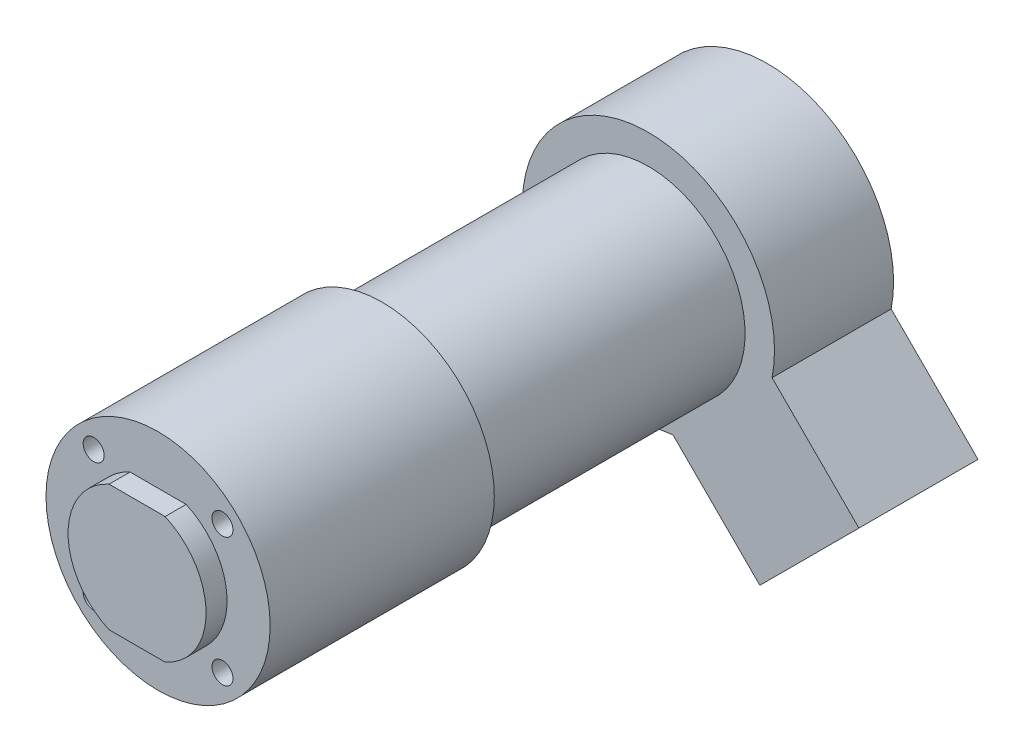
ISO-10303-21;
HEADER;
FILE_DESCRIPTION(('STEP AP214'),'2;1');
FILE_NAME('part.step','',(''),(''),'','','');
FILE_SCHEMA(('AUTOMOTIVE_DESIGN { 1 0 10303 214 1 1 1 1 }'));
ENDSEC;
DATA;
#1=APPLICATION_CONTEXT('core data for automotive mechanical design processes');
#2=APPLICATION_PROTOCOL_DEFINITION('international standard','automotive_design',2000,#1);
#3=PRODUCT_CONTEXT('',#1,'mechanical');
#4=PRODUCT('Part','Part','',(#3));
#5=PRODUCT_RELATED_PRODUCT_CATEGORY('part','',(#4));
#6=PRODUCT_DEFINITION_FORMATION('','',#4);
#7=PRODUCT_DEFINITION_CONTEXT('part definition',#1,'design');
#8=PRODUCT_DEFINITION('design','',#6,#7);
#9=PRODUCT_DEFINITION_SHAPE('','',#8);
#10=(LENGTH_UNIT() NAMED_UNIT(*) SI_UNIT(.MILLI.,.METRE.));
#11=(NAMED_UNIT(*) PLANE_ANGLE_UNIT() SI_UNIT($,.RADIAN.));
#12=(NAMED_UNIT(*) SI_UNIT($,.STERADIAN.) SOLID_ANGLE_UNIT());
#13=UNCERTAINTY_MEASURE_WITH_UNIT(LENGTH_MEASURE(1.E-05),#10,'distance_accuracy_value','');
#14=(GEOMETRIC_REPRESENTATION_CONTEXT(3) GLOBAL_UNCERTAINTY_ASSIGNED_CONTEXT((#13)) GLOBAL_UNIT_ASSIGNED_CONTEXT((#10,
#11,#12)) REPRESENTATION_CONTEXT('',''));
#15=CARTESIAN_POINT('',(0.,0.,0.));
#16=DIRECTION('',(0.,0.,1.));
#17=DIRECTION('',(1.,0.,0.));
#18=AXIS2_PLACEMENT_3D('',#15,#16,#17);
#19=CARTESIAN_POINT('',(0.,0.,3.));
#20=DIRECTION('',(0.,0.,-1.));
#21=DIRECTION('',(-1.,0.,0.));
#22=AXIS2_PLACEMENT_3D('',#19,#20,#21);
#23=CYLINDRICAL_SURFACE('',#22,9.85);
#24=CARTESIAN_POINT('',(0.,0.,0.));
#25=DIRECTION('',(0.,0.,1.));
#26=DIRECTION('',(1.,0.,0.));
#27=AXIS2_PLACEMENT_3D('',#24,#25,#26);
#28=CIRCLE('',#27,9.85);
#29=CARTESIAN_POINT('',(-4.00281151192509,9.,0.));
#30=VERTEX_POINT('',#29);
#31=CARTESIAN_POINT('',(-4.00281151192509,-9.,0.));
#32=VERTEX_POINT('',#31);
#33=EDGE_CURVE('E149',#30,#32,#28,.T.);
#34=ORIENTED_EDGE('',*,*,#33,.T.);
#35=DIRECTION('',(0.,0.,-1.));
#36=VECTOR('',#35,1.);
#37=CARTESIAN_POINT('',(-4.00281151192509,-9.,3.));
#38=LINE('',#37,#36);
#39=CARTESIAN_POINT('',(-4.00281151192509,-9.,3.));
#40=VERTEX_POINT('',#39);
#41=EDGE_CURVE('E41',#40,#32,#38,.T.);
#42=ORIENTED_EDGE('',*,*,#41,.F.);
#43=CARTESIAN_POINT('',(0.,0.,3.));
#44=DIRECTION('',(0.,0.,1.));
#45=DIRECTION('',(1.,0.,0.));
#46=AXIS2_PLACEMENT_3D('',#43,#44,#45);
#47=CIRCLE('',#46,9.85);
#48=CARTESIAN_POINT('',(-4.00281151192509,9.,3.));
#49=VERTEX_POINT('',#48);
#50=EDGE_CURVE('E152',#49,#40,#47,.T.);
#51=ORIENTED_EDGE('',*,*,#50,.F.);
#52=DIRECTION('',(0.,0.,-1.));
#53=VECTOR('',#52,1.);
#54=CARTESIAN_POINT('',(-4.00281151192509,9.,3.));
#55=LINE('',#54,#53);
#56=EDGE_CURVE('E160',#49,#30,#55,.T.);
#57=ORIENTED_EDGE('',*,*,#56,.T.);
#58=EDGE_LOOP('',(#34,#42,#51,#57));
#59=FACE_BOUND('',#58,.T.);
#60=ADVANCED_FACE('F38',(#59),#23,.T.);
#61=CARTESIAN_POINT('',(-4.00281151192509,-9.,3.));
#62=DIRECTION('',(0.,1.,0.));
#63=DIRECTION('',(-1.,0.,0.));
#64=AXIS2_PLACEMENT_3D('',#61,#62,#63);
#65=PLANE('',#64);
#66=DIRECTION('',(1.,0.,0.));
#67=VECTOR('',#66,1.);
#68=CARTESIAN_POINT('',(-4.00281151192509,-9.,0.));
#69=LINE('',#68,#67);
#70=CARTESIAN_POINT('',(4.00281151192509,-9.,0.));
#71=VERTEX_POINT('',#70);
#72=EDGE_CURVE('E163',#32,#71,#69,.T.);
#73=ORIENTED_EDGE('',*,*,#72,.T.);
#74=DIRECTION('',(0.,0.,-1.));
#75=VECTOR('',#74,1.);
#76=CARTESIAN_POINT('',(4.00281151192509,-9.,3.));
#77=LINE('',#76,#75);
#78=CARTESIAN_POINT('',(4.00281151192509,-9.,3.));
#79=VERTEX_POINT('',#78);
#80=EDGE_CURVE('E175',#79,#71,#77,.T.);
#81=ORIENTED_EDGE('',*,*,#80,.F.);
#82=DIRECTION('',(1.,0.,0.));
#83=VECTOR('',#82,1.);
#84=CARTESIAN_POINT('',(-4.00281151192509,-9.,3.));
#85=LINE('',#84,#83);
#86=EDGE_CURVE('E154',#40,#79,#85,.T.);
#87=ORIENTED_EDGE('',*,*,#86,.F.);
#88=ORIENTED_EDGE('',*,*,#41,.T.);
#89=EDGE_LOOP('',(#73,#81,#87,#88));
#90=FACE_BOUND('',#89,.T.);
#91=ADVANCED_FACE('F183',(#90),#65,.F.);
#92=CARTESIAN_POINT('',(0.,0.,3.));
#93=DIRECTION('',(0.,0.,-1.));
#94=DIRECTION('',(-1.,0.,0.));
#95=AXIS2_PLACEMENT_3D('',#92,#93,#94);
#96=CYLINDRICAL_SURFACE('',#95,9.85);
#97=CARTESIAN_POINT('',(0.,0.,0.));
#98=DIRECTION('',(0.,0.,1.));
#99=DIRECTION('',(1.,0.,0.));
#100=AXIS2_PLACEMENT_3D('',#97,#98,#99);
#101=CIRCLE('',#100,9.85);
#102=CARTESIAN_POINT('',(4.00281151192509,9.,0.));
#103=VERTEX_POINT('',#102);
#104=EDGE_CURVE('E166',#71,#103,#101,.T.);
#105=ORIENTED_EDGE('',*,*,#104,.T.);
#106=DIRECTION('',(0.,0.,-1.));
#107=VECTOR('',#106,1.);
#108=CARTESIAN_POINT('',(4.00281151192509,9.,3.));
#109=LINE('',#108,#107);
#110=CARTESIAN_POINT('',(4.00281151192509,9.,3.));
#111=VERTEX_POINT('',#110);
#112=EDGE_CURVE('E173',#111,#103,#109,.T.);
#113=ORIENTED_EDGE('',*,*,#112,.F.);
#114=CARTESIAN_POINT('',(0.,0.,3.));
#115=DIRECTION('',(0.,0.,1.));
#116=DIRECTION('',(1.,0.,0.));
#117=AXIS2_PLACEMENT_3D('',#114,#115,#116);
#118=CIRCLE('',#117,9.85);
#119=EDGE_CURVE('E157',#79,#111,#118,.T.);
#120=ORIENTED_EDGE('',*,*,#119,.F.);
#121=ORIENTED_EDGE('',*,*,#80,.T.);
#122=EDGE_LOOP('',(#105,#113,#120,#121));
#123=FACE_BOUND('',#122,.T.);
#124=ADVANCED_FACE('F193',(#123),#96,.T.);
#125=CARTESIAN_POINT('',(-4.00281151192509,9.,3.));
#126=DIRECTION('',(0.,-1.,0.));
#127=DIRECTION('',(1.,0.,0.));
#128=AXIS2_PLACEMENT_3D('',#125,#126,#127);
#129=PLANE('',#128);
#130=DIRECTION('',(-1.,0.,0.));
#131=VECTOR('',#130,1.);
#132=CARTESIAN_POINT('',(-4.00281151192509,9.,0.));
#133=LINE('',#132,#131);
#134=EDGE_CURVE('E155',#103,#30,#133,.T.);
#135=ORIENTED_EDGE('',*,*,#134,.T.);
#136=ORIENTED_EDGE('',*,*,#56,.F.);
#137=DIRECTION('',(-1.,0.,0.));
#138=VECTOR('',#137,1.);
#139=CARTESIAN_POINT('',(-4.00281151192509,9.,3.));
#140=LINE('',#139,#138);
#141=EDGE_CURVE('E54',#111,#49,#140,.T.);
#142=ORIENTED_EDGE('',*,*,#141,.F.);
#143=ORIENTED_EDGE('',*,*,#112,.T.);
#144=EDGE_LOOP('',(#135,#136,#142,#143));
#145=FACE_BOUND('',#144,.T.);
#146=ADVANCED_FACE('F191',(#145),#129,.F.);
#147=CARTESIAN_POINT('',(0.,0.,3.));
#148=DIRECTION('',(0.,0.,1.));
#149=DIRECTION('',(1.,0.,0.));
#150=AXIS2_PLACEMENT_3D('',#147,#148,#149);
#151=PLANE('',#150);
#152=ORIENTED_EDGE('',*,*,#50,.T.);
#153=ORIENTED_EDGE('',*,*,#86,.T.);
#154=ORIENTED_EDGE('',*,*,#119,.T.);
#155=ORIENTED_EDGE('',*,*,#141,.T.);
#156=EDGE_LOOP('',(#152,#153,#154,#155));
#157=FACE_BOUND('',#156,.T.);
#158=ADVANCED_FACE('F194',(#157),#151,.T.);
#159=CARTESIAN_POINT('',(0.,0.,-32.));
#160=DIRECTION('',(0.,0.,1.));
#161=DIRECTION('',(1.,0.,0.));
#162=AXIS2_PLACEMENT_3D('',#159,#160,#161);
#163=CYLINDRICAL_SURFACE('',#162,16.);
#164=CARTESIAN_POINT('',(0.,0.,-32.));
#165=DIRECTION('',(0.,0.,-1.));
#166=DIRECTION('',(-1.,0.,0.));
#167=AXIS2_PLACEMENT_3D('',#164,#165,#166);
#168=CIRCLE('',#167,16.);
#169=CARTESIAN_POINT('',(-16.,0.,-32.));
#170=VERTEX_POINT('',#169);
#171=EDGE_CURVE('E146',#170,#170,#168,.T.);
#172=ORIENTED_EDGE('',*,*,#171,.F.);
#173=EDGE_LOOP('',(#172));
#174=FACE_BOUND('',#173,.T.);
#175=CARTESIAN_POINT('',(0.,0.,0.));
#176=DIRECTION('',(0.,0.,-1.));
#177=DIRECTION('',(-1.,0.,0.));
#178=AXIS2_PLACEMENT_3D('',#175,#176,#177);
#179=CIRCLE('',#178,16.);
#180=CARTESIAN_POINT('',(-16.,0.,0.));
#181=VERTEX_POINT('',#180);
#182=EDGE_CURVE('E144',#181,#181,#179,.T.);
#183=ORIENTED_EDGE('',*,*,#182,.T.);
#184=EDGE_LOOP('',(#183));
#185=FACE_BOUND('',#184,.T.);
#186=ADVANCED_FACE('F196',(#174,#185),#163,.T.);
#187=CARTESIAN_POINT('',(0.,0.,-32.));
#188=DIRECTION('',(0.,0.,-1.));
#189=DIRECTION('',(-1.,0.,0.));
#190=AXIS2_PLACEMENT_3D('',#187,#188,#189);
#191=PLANE('',#190);
#192=CARTESIAN_POINT('',(0.,0.,-32.));
#193=DIRECTION('',(0.,0.,-1.));
#194=DIRECTION('',(-1.,0.,0.));
#195=AXIS2_PLACEMENT_3D('',#192,#193,#194);
#196=CIRCLE('',#195,13.8);
#197=CARTESIAN_POINT('',(-13.8,0.,-32.));
#198=VERTEX_POINT('',#197);
#199=EDGE_CURVE('E11',#198,#198,#196,.T.);
#200=ORIENTED_EDGE('',*,*,#199,.F.);
#201=EDGE_LOOP('',(#200));
#202=FACE_BOUND('',#201,.T.);
#203=ORIENTED_EDGE('',*,*,#171,.T.);
#204=EDGE_LOOP('',(#203));
#205=FACE_BOUND('',#204,.T.);
#206=ADVANCED_FACE('F202',(#202,#205),#191,.T.);
#207=CARTESIAN_POINT('',(0.,0.,0.));
#208=DIRECTION('',(0.,0.,-1.));
#209=DIRECTION('',(-1.,0.,0.));
#210=AXIS2_PLACEMENT_3D('',#207,#208,#209);
#211=PLANE('',#210);
#212=CARTESIAN_POINT('',(9.19238815542568,-9.19238815542455,0.));
#213=DIRECTION('',(0.,0.,1.));
#214=DIRECTION('',(1.,0.,0.));
#215=AXIS2_PLACEMENT_3D('',#212,#213,#214);
#216=CIRCLE('',#215,1.50000000000072);
#217=CARTESIAN_POINT('',(10.6923881554264,-9.19238815542455,0.));
#218=VERTEX_POINT('',#217);
#219=EDGE_CURVE('E398',#218,#218,#216,.T.);
#220=ORIENTED_EDGE('',*,*,#219,.F.);
#221=EDGE_LOOP('',(#220));
#222=FACE_BOUND('',#221,.T.);
#223=CARTESIAN_POINT('',(-9.19238815542455,-9.19238815542517,0.));
#224=DIRECTION('',(0.,0.,1.));
#225=DIRECTION('',(1.,0.,0.));
#226=AXIS2_PLACEMENT_3D('',#223,#224,#225);
#227=CIRCLE('',#226,1.50000000000027);
#228=CARTESIAN_POINT('',(-7.69238815542427,-9.19238815542517,0.));
#229=VERTEX_POINT('',#228);
#230=EDGE_CURVE('E417',#229,#229,#227,.T.);
#231=ORIENTED_EDGE('',*,*,#230,.F.);
#232=EDGE_LOOP('',(#231));
#233=FACE_BOUND('',#232,.T.);
#234=CARTESIAN_POINT('',(-9.19238815542517,9.19238815542507,0.));
#235=DIRECTION('',(0.,0.,1.));
#236=DIRECTION('',(1.,0.,0.));
#237=AXIS2_PLACEMENT_3D('',#234,#235,#236);
#238=CIRCLE('',#237,1.5);
#239=CARTESIAN_POINT('',(-7.69238815542517,9.19238815542507,0.));
#240=VERTEX_POINT('',#239);
#241=EDGE_CURVE('E408',#240,#240,#238,.T.);
#242=ORIENTED_EDGE('',*,*,#241,.F.);
#243=EDGE_LOOP('',(#242));
#244=FACE_BOUND('',#243,.T.);
#245=CARTESIAN_POINT('',(9.19238815542507,9.19238815542568,0.));
#246=DIRECTION('',(0.,0.,1.));
#247=DIRECTION('',(1.,0.,0.));
#248=AXIS2_PLACEMENT_3D('',#245,#246,#247);
#249=CIRCLE('',#248,1.50000000000053);
#250=CARTESIAN_POINT('',(10.6923881554256,9.19238815542568,0.));
#251=VERTEX_POINT('',#250);
#252=EDGE_CURVE('E406',#251,#251,#249,.T.);
#253=ORIENTED_EDGE('',*,*,#252,.F.);
#254=EDGE_LOOP('',(#253));
#255=FACE_BOUND('',#254,.T.);
#256=ORIENTED_EDGE('',*,*,#33,.F.);
#257=ORIENTED_EDGE('',*,*,#134,.F.);
#258=ORIENTED_EDGE('',*,*,#104,.F.);
#259=ORIENTED_EDGE('',*,*,#72,.F.);
#260=EDGE_LOOP('',(#256,#257,#258,#259));
#261=FACE_BOUND('',#260,.T.);
#262=ORIENTED_EDGE('',*,*,#182,.F.);
#263=EDGE_LOOP('',(#262));
#264=FACE_BOUND('',#263,.T.);
#265=ADVANCED_FACE('F187',(#222,#233,#244,#255,#261,#264),#211,.F.);
#266=CARTESIAN_POINT('',(0.,0.,-70.));
#267=DIRECTION('',(0.,0.,1.));
#268=DIRECTION('',(1.,0.,0.));
#269=AXIS2_PLACEMENT_3D('',#266,#267,#268);
#270=CYLINDRICAL_SURFACE('',#269,13.8);
#271=CARTESIAN_POINT('',(0.,0.,-70.));
#272=DIRECTION('',(0.,0.,-1.));
#273=DIRECTION('',(-1.,0.,0.));
#274=AXIS2_PLACEMENT_3D('',#271,#272,#273);
#275=CIRCLE('',#274,13.8);
#276=CARTESIAN_POINT('',(-13.8,0.,-70.));
#277=VERTEX_POINT('',#276);
#278=EDGE_CURVE('E119',#277,#277,#275,.T.);
#279=ORIENTED_EDGE('',*,*,#278,.F.);
#280=EDGE_LOOP('',(#279));
#281=FACE_BOUND('',#280,.T.);
#282=ORIENTED_EDGE('',*,*,#199,.T.);
#283=EDGE_LOOP('',(#282));
#284=FACE_BOUND('',#283,.T.);
#285=ADVANCED_FACE('F243',(#281,#284),#270,.T.);
#286=CARTESIAN_POINT('',(0.,0.,-87.));
#287=DIRECTION('',(0.,0.,1.));
#288=DIRECTION('',(1.,0.,0.));
#289=AXIS2_PLACEMENT_3D('',#286,#287,#288);
#290=CYLINDRICAL_SURFACE('',#289,18.);
#291=CARTESIAN_POINT('',(0.,0.,-70.));
#292=DIRECTION('',(0.,0.,-1.));
#293=DIRECTION('',(-1.,0.,0.));
#294=AXIS2_PLACEMENT_3D('',#291,#292,#293);
#295=CIRCLE('',#294,18.);
#296=CARTESIAN_POINT('',(3.51193743239294,-17.6540730561238,-70.));
#297=VERTEX_POINT('',#296);
#298=CARTESIAN_POINT('',(17.6540730561238,-3.51193743239285,-70.));
#299=VERTEX_POINT('',#298);
#300=EDGE_CURVE('E115',#297,#299,#295,.T.);
#301=ORIENTED_EDGE('',*,*,#300,.T.);
#302=DIRECTION('',(0.,0.,1.));
#303=VECTOR('',#302,1.);
#304=CARTESIAN_POINT('',(17.6540730561238,-3.51193743239285,-87.));
#305=LINE('',#304,#303);
#306=CARTESIAN_POINT('',(17.6540730561238,-3.51193743239285,-87.));
#307=VERTEX_POINT('',#306);
#308=EDGE_CURVE('E112',#307,#299,#305,.T.);
#309=ORIENTED_EDGE('',*,*,#308,.F.);
#310=CARTESIAN_POINT('',(0.,0.,-87.));
#311=DIRECTION('',(0.,0.,-1.));
#312=DIRECTION('',(-1.,0.,0.));
#313=AXIS2_PLACEMENT_3D('',#310,#311,#312);
#314=CIRCLE('',#313,18.);
#315=CARTESIAN_POINT('',(3.51193743239294,-17.6540730561238,-87.));
#316=VERTEX_POINT('',#315);
#317=EDGE_CURVE('E99',#316,#307,#314,.T.);
#318=ORIENTED_EDGE('',*,*,#317,.F.);
#319=DIRECTION('',(0.,0.,1.));
#320=VECTOR('',#319,1.);
#321=CARTESIAN_POINT('',(3.51193743239294,-17.6540730561238,-87.));
#322=LINE('',#321,#320);
#323=EDGE_CURVE('E130',#316,#297,#322,.T.);
#324=ORIENTED_EDGE('',*,*,#323,.T.);
#325=EDGE_LOOP('',(#301,#309,#318,#324));
#326=FACE_BOUND('',#325,.T.);
#327=ADVANCED_FACE('F113',(#326),#290,.T.);
#328=CARTESIAN_POINT('',(7.07106781186548,7.07106781186549,-87.));
#329=DIRECTION('',(0.707106781186547,0.707106781186548,0.));
#330=DIRECTION('',(-0.707106781186548,0.707106781186547,0.));
#331=AXIS2_PLACEMENT_3D('',#328,#329,#330);
#332=PLANE('',#331);
#333=DIRECTION('',(-0.707106781186548,0.707106781186547,0.));
#334=VECTOR('',#333,1.);
#335=CARTESIAN_POINT('',(7.07106781186548,7.07106781186549,-70.));
#336=LINE('',#335,#334);
#337=CARTESIAN_POINT('',(30.0520382004283,-15.9099025766973,-70.));
#338=VERTEX_POINT('',#337);
#339=EDGE_CURVE('E132',#338,#299,#336,.T.);
#340=ORIENTED_EDGE('',*,*,#339,.F.);
#341=DIRECTION('',(0.,0.,1.));
#342=VECTOR('',#341,1.);
#343=CARTESIAN_POINT('',(30.0520382004283,-15.9099025766973,-87.));
#344=LINE('',#343,#342);
#345=CARTESIAN_POINT('',(30.0520382004283,-15.9099025766973,-87.));
#346=VERTEX_POINT('',#345);
#347=EDGE_CURVE('E120',#346,#338,#344,.T.);
#348=ORIENTED_EDGE('',*,*,#347,.F.);
#349=DIRECTION('',(-0.707106781186548,0.707106781186547,0.));
#350=VECTOR('',#349,1.);
#351=CARTESIAN_POINT('',(7.07106781186548,7.07106781186549,-87.));
#352=LINE('',#351,#350);
#353=EDGE_CURVE('E103',#346,#307,#352,.T.);
#354=ORIENTED_EDGE('',*,*,#353,.T.);
#355=ORIENTED_EDGE('',*,*,#308,.T.);
#356=EDGE_LOOP('',(#340,#348,#354,#355));
#357=FACE_BOUND('',#356,.T.);
#358=ADVANCED_FACE('F122',(#357),#332,.T.);
#359=CARTESIAN_POINT('',(22.9809703885628,-22.9809703885628,-87.));
#360=DIRECTION('',(-0.707106781186548,0.707106781186547,0.));
#361=DIRECTION('',(-0.707106781186547,-0.707106781186548,0.));
#362=AXIS2_PLACEMENT_3D('',#359,#360,#361);
#363=PLANE('',#362);
#364=DIRECTION('',(-0.707106781186547,-0.707106781186548,0.));
#365=VECTOR('',#364,1.);
#366=CARTESIAN_POINT('',(22.9809703885628,-22.9809703885628,-70.));
#367=LINE('',#366,#365);
#368=CARTESIAN_POINT('',(15.9099025766974,-30.0520382004282,-70.));
#369=VERTEX_POINT('',#368);
#370=EDGE_CURVE('E135',#338,#369,#367,.T.);
#371=ORIENTED_EDGE('',*,*,#370,.T.);
#372=DIRECTION('',(0.,0.,1.));
#373=VECTOR('',#372,1.);
#374=CARTESIAN_POINT('',(15.9099025766974,-30.0520382004282,-87.));
#375=LINE('',#374,#373);
#376=CARTESIAN_POINT('',(15.9099025766974,-30.0520382004282,-87.));
#377=VERTEX_POINT('',#376);
#378=EDGE_CURVE('E139',#377,#369,#375,.T.);
#379=ORIENTED_EDGE('',*,*,#378,.F.);
#380=DIRECTION('',(-0.707106781186547,-0.707106781186548,0.));
#381=VECTOR('',#380,1.);
#382=CARTESIAN_POINT('',(22.9809703885628,-22.9809703885628,-87.));
#383=LINE('',#382,#381);
#384=EDGE_CURVE('E124',#346,#377,#383,.T.);
#385=ORIENTED_EDGE('',*,*,#384,.F.);
#386=ORIENTED_EDGE('',*,*,#347,.T.);
#387=EDGE_LOOP('',(#371,#379,#385,#386));
#388=FACE_BOUND('',#387,.T.);
#389=ADVANCED_FACE('F265',(#388),#363,.F.);
#390=CARTESIAN_POINT('',(-7.07106781186544,-7.07106781186544,-87.));
#391=DIRECTION('',(0.707106781186547,0.707106781186547,0.));
#392=DIRECTION('',(-0.707106781186548,0.707106781186548,0.));
#393=AXIS2_PLACEMENT_3D('',#390,#391,#392);
#394=PLANE('',#393);
#395=DIRECTION('',(-0.707106781186548,0.707106781186548,0.));
#396=VECTOR('',#395,1.);
#397=CARTESIAN_POINT('',(-7.07106781186544,-7.07106781186544,-70.));
#398=LINE('',#397,#396);
#399=EDGE_CURVE('E109',#369,#297,#398,.T.);
#400=ORIENTED_EDGE('',*,*,#399,.T.);
#401=ORIENTED_EDGE('',*,*,#323,.F.);
#402=DIRECTION('',(-0.707106781186548,0.707106781186548,0.));
#403=VECTOR('',#402,1.);
#404=CARTESIAN_POINT('',(-7.07106781186544,-7.07106781186544,-87.));
#405=LINE('',#404,#403);
#406=EDGE_CURVE('E105',#377,#316,#405,.T.);
#407=ORIENTED_EDGE('',*,*,#406,.F.);
#408=ORIENTED_EDGE('',*,*,#378,.T.);
#409=EDGE_LOOP('',(#400,#401,#407,#408));
#410=FACE_BOUND('',#409,.T.);
#411=ADVANCED_FACE('F274',(#410),#394,.F.);
#412=CARTESIAN_POINT('',(0.,0.,-87.));
#413=DIRECTION('',(0.,0.,-1.));
#414=DIRECTION('',(-1.,0.,0.));
#415=AXIS2_PLACEMENT_3D('',#412,#413,#414);
#416=PLANE('',#415);
#417=ORIENTED_EDGE('',*,*,#317,.T.);
#418=ORIENTED_EDGE('',*,*,#353,.F.);
#419=ORIENTED_EDGE('',*,*,#384,.T.);
#420=ORIENTED_EDGE('',*,*,#406,.T.);
#421=EDGE_LOOP('',(#417,#418,#419,#420));
#422=FACE_BOUND('',#421,.T.);
#423=ADVANCED_FACE('F101',(#422),#416,.T.);
#424=CARTESIAN_POINT('',(0.,0.,-70.));
#425=DIRECTION('',(0.,0.,-1.));
#426=DIRECTION('',(-1.,0.,0.));
#427=AXIS2_PLACEMENT_3D('',#424,#425,#426);
#428=PLANE('',#427);
#429=ORIENTED_EDGE('',*,*,#278,.T.);
#430=EDGE_LOOP('',(#429));
#431=FACE_BOUND('',#430,.T.);
#432=ORIENTED_EDGE('',*,*,#300,.F.);
#433=ORIENTED_EDGE('',*,*,#399,.F.);
#434=ORIENTED_EDGE('',*,*,#370,.F.);
#435=ORIENTED_EDGE('',*,*,#339,.T.);
#436=EDGE_LOOP('',(#432,#433,#434,#435));
#437=FACE_BOUND('',#436,.T.);
#438=ADVANCED_FACE('F294',(#431,#437),#428,.F.);
#439=CARTESIAN_POINT('',(9.19238815542507,9.19238815542568,-10.));
#440=DIRECTION('',(0.,0.,1.));
#441=DIRECTION('',(1.,0.,0.));
#442=AXIS2_PLACEMENT_3D('',#439,#440,#441);
#443=CYLINDRICAL_SURFACE('',#442,1.50000000000053);
#444=CARTESIAN_POINT('',(9.19238815542507,9.19238815542568,-10.));
#445=DIRECTION('',(0.,0.,1.));
#446=DIRECTION('',(1.,0.,0.));
#447=AXIS2_PLACEMENT_3D('',#444,#445,#446);
#448=CIRCLE('',#447,1.50000000000053);
#449=CARTESIAN_POINT('',(10.6923881554256,9.19238815542568,-10.));
#450=VERTEX_POINT('',#449);
#451=EDGE_CURVE('E133',#450,#450,#448,.T.);
#452=ORIENTED_EDGE('',*,*,#451,.F.);
#453=EDGE_LOOP('',(#452));
#454=FACE_BOUND('',#453,.T.);
#455=ORIENTED_EDGE('',*,*,#252,.T.);
#456=EDGE_LOOP('',(#455));
#457=FACE_BOUND('',#456,.T.);
#458=ADVANCED_FACE('F304',(#454,#457),#443,.F.);
#459=CARTESIAN_POINT('',(9.19238815542507,9.19238815542568,-10.));
#460=DIRECTION('',(0.,0.,1.));
#461=DIRECTION('',(1.,0.,0.));
#462=AXIS2_PLACEMENT_3D('',#459,#460,#461);
#463=PLANE('',#462);
#464=ORIENTED_EDGE('',*,*,#451,.T.);
#465=EDGE_LOOP('',(#464));
#466=FACE_BOUND('',#465,.T.);
#467=ADVANCED_FACE('F321',(#466),#463,.T.);
#468=CARTESIAN_POINT('',(-9.19238815542517,9.19238815542507,-10.));
#469=DIRECTION('',(0.,0.,1.));
#470=DIRECTION('',(1.,0.,0.));
#471=AXIS2_PLACEMENT_3D('',#468,#469,#470);
#472=CYLINDRICAL_SURFACE('',#471,1.5);
#473=CARTESIAN_POINT('',(-9.19238815542517,9.19238815542507,-10.));
#474=DIRECTION('',(0.,0.,1.));
#475=DIRECTION('',(1.,0.,0.));
#476=AXIS2_PLACEMENT_3D('',#473,#474,#475);
#477=CIRCLE('',#476,1.5);
#478=CARTESIAN_POINT('',(-7.69238815542517,9.19238815542507,-10.));
#479=VERTEX_POINT('',#478);
#480=EDGE_CURVE('E412',#479,#479,#477,.T.);
#481=ORIENTED_EDGE('',*,*,#480,.F.);
#482=EDGE_LOOP('',(#481));
#483=FACE_BOUND('',#482,.T.);
#484=ORIENTED_EDGE('',*,*,#241,.T.);
#485=EDGE_LOOP('',(#484));
#486=FACE_BOUND('',#485,.T.);
#487=ADVANCED_FACE('F331',(#483,#486),#472,.F.);
#488=CARTESIAN_POINT('',(-9.19238815542517,9.19238815542507,-10.));
#489=DIRECTION('',(0.,0.,1.));
#490=DIRECTION('',(1.,0.,0.));
#491=AXIS2_PLACEMENT_3D('',#488,#489,#490);
#492=PLANE('',#491);
#493=ORIENTED_EDGE('',*,*,#480,.T.);
#494=EDGE_LOOP('',(#493));
#495=FACE_BOUND('',#494,.T.);
#496=ADVANCED_FACE('F341',(#495),#492,.T.);
#497=CARTESIAN_POINT('',(-9.19238815542455,-9.19238815542517,-10.));
#498=DIRECTION('',(0.,0.,1.));
#499=DIRECTION('',(1.,0.,0.));
#500=AXIS2_PLACEMENT_3D('',#497,#498,#499);
#501=CYLINDRICAL_SURFACE('',#500,1.50000000000027);
#502=CARTESIAN_POINT('',(-9.19238815542455,-9.19238815542517,-10.));
#503=DIRECTION('',(0.,0.,1.));
#504=DIRECTION('',(1.,0.,0.));
#505=AXIS2_PLACEMENT_3D('',#502,#503,#504);
#506=CIRCLE('',#505,1.50000000000027);
#507=CARTESIAN_POINT('',(-7.69238815542427,-9.19238815542517,-10.));
#508=VERTEX_POINT('',#507);
#509=EDGE_CURVE('E401',#508,#508,#506,.T.);
#510=ORIENTED_EDGE('',*,*,#509,.F.);
#511=EDGE_LOOP('',(#510));
#512=FACE_BOUND('',#511,.T.);
#513=ORIENTED_EDGE('',*,*,#230,.T.);
#514=EDGE_LOOP('',(#513));
#515=FACE_BOUND('',#514,.T.);
#516=ADVANCED_FACE('F351',(#512,#515),#501,.F.);
#517=CARTESIAN_POINT('',(-9.19238815542455,-9.19238815542517,-10.));
#518=DIRECTION('',(0.,0.,1.));
#519=DIRECTION('',(1.,0.,0.));
#520=AXIS2_PLACEMENT_3D('',#517,#518,#519);
#521=PLANE('',#520);
#522=ORIENTED_EDGE('',*,*,#509,.T.);
#523=EDGE_LOOP('',(#522));
#524=FACE_BOUND('',#523,.T.);
#525=ADVANCED_FACE('F361',(#524),#521,.T.);
#526=CARTESIAN_POINT('',(9.19238815542568,-9.19238815542455,-10.));
#527=DIRECTION('',(0.,0.,1.));
#528=DIRECTION('',(1.,0.,0.));
#529=AXIS2_PLACEMENT_3D('',#526,#527,#528);
#530=CYLINDRICAL_SURFACE('',#529,1.50000000000072);
#531=CARTESIAN_POINT('',(9.19238815542568,-9.19238815542455,-10.));
#532=DIRECTION('',(0.,0.,1.));
#533=DIRECTION('',(1.,0.,0.));
#534=AXIS2_PLACEMENT_3D('',#531,#532,#533);
#535=CIRCLE('',#534,1.50000000000072);
#536=CARTESIAN_POINT('',(10.6923881554264,-9.19238815542455,-10.));
#537=VERTEX_POINT('',#536);
#538=EDGE_CURVE('E397',#537,#537,#535,.T.);
#539=ORIENTED_EDGE('',*,*,#538,.F.);
#540=EDGE_LOOP('',(#539));
#541=FACE_BOUND('',#540,.T.);
#542=ORIENTED_EDGE('',*,*,#219,.T.);
#543=EDGE_LOOP('',(#542));
#544=FACE_BOUND('',#543,.T.);
#545=ADVANCED_FACE('F371',(#541,#544),#530,.F.);
#546=CARTESIAN_POINT('',(9.19238815542568,-9.19238815542455,-10.));
#547=DIRECTION('',(0.,0.,1.));
#548=DIRECTION('',(1.,0.,0.));
#549=AXIS2_PLACEMENT_3D('',#546,#547,#548);
#550=PLANE('',#549);
#551=ORIENTED_EDGE('',*,*,#538,.T.);
#552=EDGE_LOOP('',(#551));
#553=FACE_BOUND('',#552,.T.);
#554=ADVANCED_FACE('F381',(#553),#550,.T.);
#555=CLOSED_SHELL('',(#60,#91,#124,#146,#158,#186,#206,#265,#285,#327,#358,#389,#411,#423,#438,
#458,#467,#487,#496,#516,#525,#545,#554));
#556=MANIFOLD_SOLID_BREP('B2',#555);
#557=ADVANCED_BREP_SHAPE_REPRESENTATION('',(#18,#556),#14);
#558=SHAPE_DEFINITION_REPRESENTATION(#9,#557);
ENDSEC;
END-ISO-10303-21;
